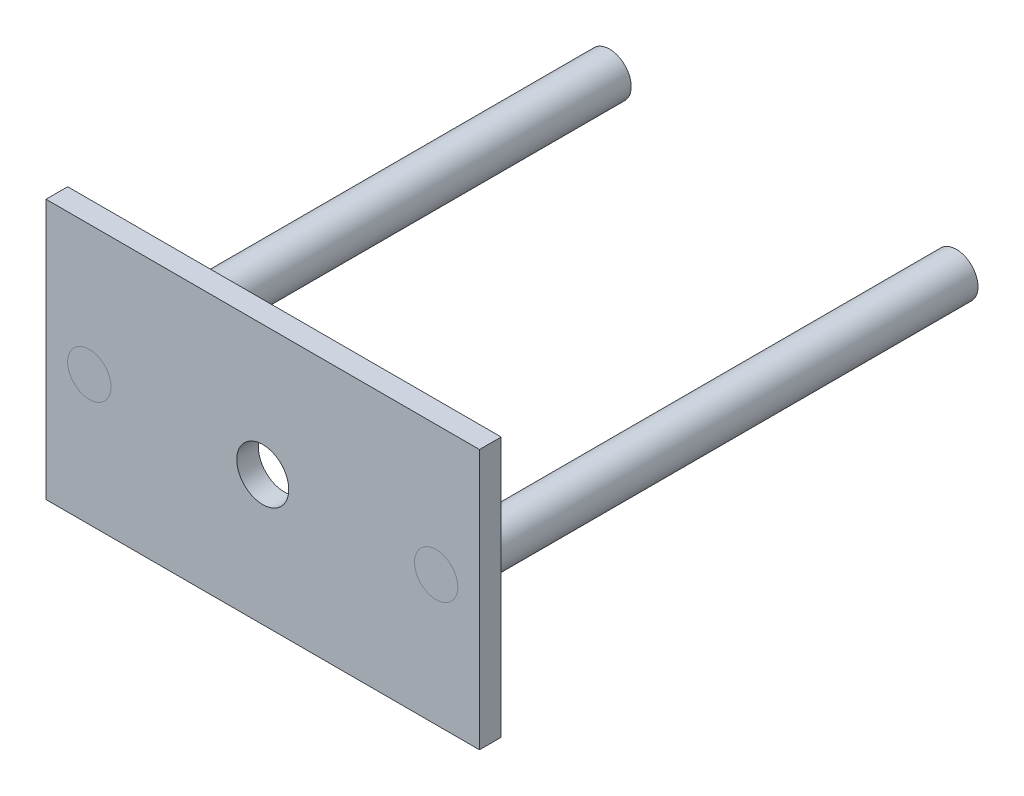
ISO-10303-21;
HEADER;
FILE_DESCRIPTION(('STEP AP214'),'2;1');
FILE_NAME('part.step','',(''),(''),'','','');
FILE_SCHEMA(('AUTOMOTIVE_DESIGN { 1 0 10303 214 1 1 1 1 }'));
ENDSEC;
DATA;
#1=APPLICATION_CONTEXT('core data for automotive mechanical design processes');
#2=APPLICATION_PROTOCOL_DEFINITION('international standard','automotive_design',2000,#1);
#3=PRODUCT_CONTEXT('',#1,'mechanical');
#4=PRODUCT('Part','Part','',(#3));
#5=PRODUCT_RELATED_PRODUCT_CATEGORY('part','',(#4));
#6=PRODUCT_DEFINITION_FORMATION('','',#4);
#7=PRODUCT_DEFINITION_CONTEXT('part definition',#1,'design');
#8=PRODUCT_DEFINITION('design','',#6,#7);
#9=PRODUCT_DEFINITION_SHAPE('','',#8);
#10=(LENGTH_UNIT() NAMED_UNIT(*) SI_UNIT(.MILLI.,.METRE.));
#11=(NAMED_UNIT(*) PLANE_ANGLE_UNIT() SI_UNIT($,.RADIAN.));
#12=(NAMED_UNIT(*) SI_UNIT($,.STERADIAN.) SOLID_ANGLE_UNIT());
#13=UNCERTAINTY_MEASURE_WITH_UNIT(LENGTH_MEASURE(1.E-05),#10,'distance_accuracy_value','');
#14=(GEOMETRIC_REPRESENTATION_CONTEXT(3) GLOBAL_UNCERTAINTY_ASSIGNED_CONTEXT((#13)) GLOBAL_UNIT_ASSIGNED_CONTEXT((#10,
#11,#12)) REPRESENTATION_CONTEXT('',''));
#15=CARTESIAN_POINT('',(0.,0.,0.));
#16=DIRECTION('',(0.,0.,1.));
#17=DIRECTION('',(1.,0.,0.));
#18=AXIS2_PLACEMENT_3D('',#15,#16,#17);
#19=CARTESIAN_POINT('',(-40.,0.,-115.));
#20=DIRECTION('',(0.,0.,1.));
#21=DIRECTION('',(1.,0.,0.));
#22=AXIS2_PLACEMENT_3D('',#19,#20,#21);
#23=CYLINDRICAL_SURFACE('',#22,5.);
#24=CARTESIAN_POINT('',(-40.,0.,-115.));
#25=DIRECTION('',(0.,0.,1.));
#26=DIRECTION('',(1.,0.,0.));
#27=AXIS2_PLACEMENT_3D('',#24,#25,#26);
#28=CIRCLE('',#27,5.);
#29=CARTESIAN_POINT('',(-35.,0.,-115.));
#30=VERTEX_POINT('',#29);
#31=EDGE_CURVE('E13',#30,#30,#28,.T.);
#32=ORIENTED_EDGE('',*,*,#31,.T.);
#33=EDGE_LOOP('',(#32));
#34=FACE_BOUND('',#33,.T.);
#35=CARTESIAN_POINT('',(-40.,0.,5.));
#36=DIRECTION('',(0.,0.,1.));
#37=DIRECTION('',(1.,0.,0.));
#38=AXIS2_PLACEMENT_3D('',#35,#36,#37);
#39=CIRCLE('',#38,5.);
#40=CARTESIAN_POINT('',(-35.,0.,5.));
#41=VERTEX_POINT('',#40);
#42=EDGE_CURVE('E60',#41,#41,#39,.T.);
#43=ORIENTED_EDGE('',*,*,#42,.F.);
#44=EDGE_LOOP('',(#43));
#45=FACE_BOUND('',#44,.T.);
#46=ADVANCED_FACE('F57',(#34,#45),#23,.T.);
#47=CARTESIAN_POINT('',(-40.,0.,-115.));
#48=DIRECTION('',(0.,0.,1.));
#49=DIRECTION('',(1.,0.,0.));
#50=AXIS2_PLACEMENT_3D('',#47,#48,#49);
#51=PLANE('',#50);
#52=ORIENTED_EDGE('',*,*,#31,.F.);
#53=EDGE_LOOP('',(#52));
#54=FACE_BOUND('',#53,.T.);
#55=ADVANCED_FACE('F72',(#54),#51,.F.);
#56=CARTESIAN_POINT('',(-40.,0.,5.));
#57=DIRECTION('',(0.,0.,1.));
#58=DIRECTION('',(1.,0.,0.));
#59=AXIS2_PLACEMENT_3D('',#56,#57,#58);
#60=PLANE('',#59);
#61=ORIENTED_EDGE('',*,*,#42,.T.);
#62=EDGE_LOOP('',(#61));
#63=FACE_BOUND('',#62,.T.);
#64=ADVANCED_FACE('F69',(#63),#60,.T.);
#65=CLOSED_SHELL('',(#46,#55,#64));
#66=MANIFOLD_SOLID_BREP('B2',#65);
#67=CARTESIAN_POINT('',(40.,0.,-115.));
#68=DIRECTION('',(0.,0.,1.));
#69=DIRECTION('',(1.,0.,0.));
#70=AXIS2_PLACEMENT_3D('',#67,#68,#69);
#71=CYLINDRICAL_SURFACE('',#70,5.);
#72=CARTESIAN_POINT('',(40.,0.,-115.));
#73=DIRECTION('',(0.,0.,1.));
#74=DIRECTION('',(1.,0.,0.));
#75=AXIS2_PLACEMENT_3D('',#72,#73,#74);
#76=CIRCLE('',#75,5.);
#77=CARTESIAN_POINT('',(45.,0.,-115.));
#78=VERTEX_POINT('',#77);
#79=EDGE_CURVE('E56',#78,#78,#76,.T.);
#80=ORIENTED_EDGE('',*,*,#79,.T.);
#81=EDGE_LOOP('',(#80));
#82=FACE_BOUND('',#81,.T.);
#83=CARTESIAN_POINT('',(40.,0.,5.));
#84=DIRECTION('',(0.,0.,1.));
#85=DIRECTION('',(1.,0.,0.));
#86=AXIS2_PLACEMENT_3D('',#83,#84,#85);
#87=CIRCLE('',#86,5.);
#88=CARTESIAN_POINT('',(45.,0.,5.));
#89=VERTEX_POINT('',#88);
#90=EDGE_CURVE('E117',#89,#89,#87,.T.);
#91=ORIENTED_EDGE('',*,*,#90,.F.);
#92=EDGE_LOOP('',(#91));
#93=FACE_BOUND('',#92,.T.);
#94=ADVANCED_FACE('F114',(#82,#93),#71,.T.);
#95=CARTESIAN_POINT('',(40.,0.,-115.));
#96=DIRECTION('',(0.,0.,1.));
#97=DIRECTION('',(1.,0.,0.));
#98=AXIS2_PLACEMENT_3D('',#95,#96,#97);
#99=PLANE('',#98);
#100=ORIENTED_EDGE('',*,*,#79,.F.);
#101=EDGE_LOOP('',(#100));
#102=FACE_BOUND('',#101,.T.);
#103=ADVANCED_FACE('F129',(#102),#99,.F.);
#104=CARTESIAN_POINT('',(40.,0.,5.));
#105=DIRECTION('',(0.,0.,1.));
#106=DIRECTION('',(1.,0.,0.));
#107=AXIS2_PLACEMENT_3D('',#104,#105,#106);
#108=PLANE('',#107);
#109=ORIENTED_EDGE('',*,*,#90,.T.);
#110=EDGE_LOOP('',(#109));
#111=FACE_BOUND('',#110,.T.);
#112=ADVANCED_FACE('F126',(#111),#108,.T.);
#113=CLOSED_SHELL('',(#94,#103,#112));
#114=MANIFOLD_SOLID_BREP('B8',#113);
#115=CARTESIAN_POINT('',(0.,0.,5.));
#116=DIRECTION('',(0.,0.,-1.));
#117=DIRECTION('',(-1.,0.,0.));
#118=AXIS2_PLACEMENT_3D('',#115,#116,#117);
#119=PLANE('',#118);
#120=DIRECTION('',(0.,1.,0.));
#121=VECTOR('',#120,1.);
#122=CARTESIAN_POINT('',(50.,-30.,5.));
#123=LINE('',#122,#121);
#124=CARTESIAN_POINT('',(50.,-30.,5.));
#125=VERTEX_POINT('',#124);
#126=CARTESIAN_POINT('',(50.,30.,5.));
#127=VERTEX_POINT('',#126);
#128=EDGE_CURVE('E212',#125,#127,#123,.T.);
#129=ORIENTED_EDGE('',*,*,#128,.T.);
#130=DIRECTION('',(-1.,0.,0.));
#131=VECTOR('',#130,1.);
#132=CARTESIAN_POINT('',(-50.,30.,5.));
#133=LINE('',#132,#131);
#134=CARTESIAN_POINT('',(-50.,30.,5.));
#135=VERTEX_POINT('',#134);
#136=EDGE_CURVE('E207',#127,#135,#133,.T.);
#137=ORIENTED_EDGE('',*,*,#136,.T.);
#138=DIRECTION('',(0.,-1.,0.));
#139=VECTOR('',#138,1.);
#140=CARTESIAN_POINT('',(-50.,-30.,5.));
#141=LINE('',#140,#139);
#142=CARTESIAN_POINT('',(-50.,-30.,5.));
#143=VERTEX_POINT('',#142);
#144=EDGE_CURVE('E210',#135,#143,#141,.T.);
#145=ORIENTED_EDGE('',*,*,#144,.T.);
#146=DIRECTION('',(1.,0.,0.));
#147=VECTOR('',#146,1.);
#148=CARTESIAN_POINT('',(-50.,-30.,5.));
#149=LINE('',#148,#147);
#150=EDGE_CURVE('E177',#143,#125,#149,.T.);
#151=ORIENTED_EDGE('',*,*,#150,.T.);
#152=EDGE_LOOP('',(#129,#137,#145,#151));
#153=FACE_BOUND('',#152,.T.);
#154=CARTESIAN_POINT('',(0.,0.,5.));
#155=DIRECTION('',(0.,0.,1.));
#156=DIRECTION('',(1.,0.,0.));
#157=AXIS2_PLACEMENT_3D('',#154,#155,#156);
#158=CIRCLE('',#157,6.);
#159=CARTESIAN_POINT('',(6.,0.,5.));
#160=VERTEX_POINT('',#159);
#161=EDGE_CURVE('E227',#160,#160,#158,.T.);
#162=ORIENTED_EDGE('',*,*,#161,.F.);
#163=EDGE_LOOP('',(#162));
#164=FACE_BOUND('',#163,.T.);
#165=CARTESIAN_POINT('',(-40.,0.,5.));
#166=DIRECTION('',(0.,0.,1.));
#167=DIRECTION('',(1.,0.,0.));
#168=AXIS2_PLACEMENT_3D('',#165,#166,#167);
#169=CIRCLE('',#168,5.);
#170=CARTESIAN_POINT('',(-35.,0.,5.));
#171=VERTEX_POINT('',#170);
#172=EDGE_CURVE('E242',#171,#171,#169,.T.);
#173=ORIENTED_EDGE('',*,*,#172,.F.);
#174=EDGE_LOOP('',(#173));
#175=FACE_BOUND('',#174,.T.);
#176=CARTESIAN_POINT('',(40.,0.,5.));
#177=DIRECTION('',(0.,0.,1.));
#178=DIRECTION('',(1.,0.,0.));
#179=AXIS2_PLACEMENT_3D('',#176,#177,#178);
#180=CIRCLE('',#179,5.);
#181=CARTESIAN_POINT('',(45.,0.,5.));
#182=VERTEX_POINT('',#181);
#183=EDGE_CURVE('E248',#182,#182,#180,.T.);
#184=ORIENTED_EDGE('',*,*,#183,.F.);
#185=EDGE_LOOP('',(#184));
#186=FACE_BOUND('',#185,.T.);
#187=ADVANCED_FACE('F160',(#153,#164,#175,#186),#119,.F.);
#188=CARTESIAN_POINT('',(0.,0.,0.));
#189=DIRECTION('',(0.,0.,-1.));
#190=DIRECTION('',(-1.,0.,0.));
#191=AXIS2_PLACEMENT_3D('',#188,#189,#190);
#192=PLANE('',#191);
#193=CARTESIAN_POINT('',(-40.,0.,0.));
#194=DIRECTION('',(0.,0.,1.));
#195=DIRECTION('',(1.,0.,0.));
#196=AXIS2_PLACEMENT_3D('',#193,#194,#195);
#197=CIRCLE('',#196,5.);
#198=CARTESIAN_POINT('',(-35.,0.,0.));
#199=VERTEX_POINT('',#198);
#200=EDGE_CURVE('E245',#199,#199,#197,.T.);
#201=ORIENTED_EDGE('',*,*,#200,.T.);
#202=EDGE_LOOP('',(#201));
#203=FACE_BOUND('',#202,.T.);
#204=DIRECTION('',(0.,1.,0.));
#205=VECTOR('',#204,1.);
#206=CARTESIAN_POINT('',(50.,-30.,0.));
#207=LINE('',#206,#205);
#208=CARTESIAN_POINT('',(50.,-30.,0.));
#209=VERTEX_POINT('',#208);
#210=CARTESIAN_POINT('',(50.,30.,0.));
#211=VERTEX_POINT('',#210);
#212=EDGE_CURVE('E224',#209,#211,#207,.T.);
#213=ORIENTED_EDGE('',*,*,#212,.F.);
#214=DIRECTION('',(1.,0.,0.));
#215=VECTOR('',#214,1.);
#216=CARTESIAN_POINT('',(-50.,-30.,0.));
#217=LINE('',#216,#215);
#218=CARTESIAN_POINT('',(-50.,-30.,0.));
#219=VERTEX_POINT('',#218);
#220=EDGE_CURVE('E200',#219,#209,#217,.T.);
#221=ORIENTED_EDGE('',*,*,#220,.F.);
#222=DIRECTION('',(0.,-1.,0.));
#223=VECTOR('',#222,1.);
#224=CARTESIAN_POINT('',(-50.,-30.,0.));
#225=LINE('',#224,#223);
#226=CARTESIAN_POINT('',(-50.,30.,0.));
#227=VERTEX_POINT('',#226);
#228=EDGE_CURVE('E194',#227,#219,#225,.T.);
#229=ORIENTED_EDGE('',*,*,#228,.F.);
#230=DIRECTION('',(-1.,0.,0.));
#231=VECTOR('',#230,1.);
#232=CARTESIAN_POINT('',(-50.,30.,0.));
#233=LINE('',#232,#231);
#234=EDGE_CURVE('E216',#211,#227,#233,.T.);
#235=ORIENTED_EDGE('',*,*,#234,.F.);
#236=EDGE_LOOP('',(#213,#221,#229,#235));
#237=FACE_BOUND('',#236,.T.);
#238=CARTESIAN_POINT('',(0.,0.,0.));
#239=DIRECTION('',(0.,0.,1.));
#240=DIRECTION('',(1.,0.,0.));
#241=AXIS2_PLACEMENT_3D('',#238,#239,#240);
#242=CIRCLE('',#241,6.);
#243=CARTESIAN_POINT('',(6.,0.,0.));
#244=VERTEX_POINT('',#243);
#245=EDGE_CURVE('E239',#244,#244,#242,.T.);
#246=ORIENTED_EDGE('',*,*,#245,.T.);
#247=EDGE_LOOP('',(#246));
#248=FACE_BOUND('',#247,.T.);
#249=CARTESIAN_POINT('',(40.,0.,0.));
#250=DIRECTION('',(0.,0.,1.));
#251=DIRECTION('',(1.,0.,0.));
#252=AXIS2_PLACEMENT_3D('',#249,#250,#251);
#253=CIRCLE('',#252,5.);
#254=CARTESIAN_POINT('',(45.,0.,0.));
#255=VERTEX_POINT('',#254);
#256=EDGE_CURVE('E251',#255,#255,#253,.T.);
#257=ORIENTED_EDGE('',*,*,#256,.T.);
#258=EDGE_LOOP('',(#257));
#259=FACE_BOUND('',#258,.T.);
#260=ADVANCED_FACE('F235',(#203,#237,#248,#259),#192,.T.);
#261=CARTESIAN_POINT('',(50.,-30.,5.));
#262=DIRECTION('',(-1.,0.,0.));
#263=DIRECTION('',(0.,0.,1.));
#264=AXIS2_PLACEMENT_3D('',#261,#262,#263);
#265=PLANE('',#264);
#266=ORIENTED_EDGE('',*,*,#212,.T.);
#267=DIRECTION('',(0.,0.,-1.));
#268=VECTOR('',#267,1.);
#269=CARTESIAN_POINT('',(50.,30.,5.));
#270=LINE('',#269,#268);
#271=EDGE_CURVE('E112',#127,#211,#270,.T.);
#272=ORIENTED_EDGE('',*,*,#271,.F.);
#273=ORIENTED_EDGE('',*,*,#128,.F.);
#274=DIRECTION('',(0.,0.,-1.));
#275=VECTOR('',#274,1.);
#276=CARTESIAN_POINT('',(50.,-30.,5.));
#277=LINE('',#276,#275);
#278=EDGE_CURVE('E220',#125,#209,#277,.T.);
#279=ORIENTED_EDGE('',*,*,#278,.T.);
#280=EDGE_LOOP('',(#266,#272,#273,#279));
#281=FACE_BOUND('',#280,.T.);
#282=ADVANCED_FACE('F162',(#281),#265,.F.);
#283=CARTESIAN_POINT('',(-50.,30.,5.));
#284=DIRECTION('',(0.,-1.,0.));
#285=DIRECTION('',(0.,0.,-1.));
#286=AXIS2_PLACEMENT_3D('',#283,#284,#285);
#287=PLANE('',#286);
#288=ORIENTED_EDGE('',*,*,#234,.T.);
#289=DIRECTION('',(0.,0.,-1.));
#290=VECTOR('',#289,1.);
#291=CARTESIAN_POINT('',(-50.,30.,5.));
#292=LINE('',#291,#290);
#293=EDGE_CURVE('E169',#135,#227,#292,.T.);
#294=ORIENTED_EDGE('',*,*,#293,.F.);
#295=ORIENTED_EDGE('',*,*,#136,.F.);
#296=ORIENTED_EDGE('',*,*,#271,.T.);
#297=EDGE_LOOP('',(#288,#294,#295,#296));
#298=FACE_BOUND('',#297,.T.);
#299=ADVANCED_FACE('F215',(#298),#287,.F.);
#300=CARTESIAN_POINT('',(-50.,-30.,5.));
#301=DIRECTION('',(1.,0.,0.));
#302=DIRECTION('',(0.,0.,-1.));
#303=AXIS2_PLACEMENT_3D('',#300,#301,#302);
#304=PLANE('',#303);
#305=ORIENTED_EDGE('',*,*,#228,.T.);
#306=DIRECTION('',(0.,0.,-1.));
#307=VECTOR('',#306,1.);
#308=CARTESIAN_POINT('',(-50.,-30.,5.));
#309=LINE('',#308,#307);
#310=EDGE_CURVE('E217',#143,#219,#309,.T.);
#311=ORIENTED_EDGE('',*,*,#310,.F.);
#312=ORIENTED_EDGE('',*,*,#144,.F.);
#313=ORIENTED_EDGE('',*,*,#293,.T.);
#314=EDGE_LOOP('',(#305,#311,#312,#313));
#315=FACE_BOUND('',#314,.T.);
#316=ADVANCED_FACE('F218',(#315),#304,.F.);
#317=CARTESIAN_POINT('',(-50.,-30.,5.));
#318=DIRECTION('',(0.,1.,0.));
#319=DIRECTION('',(0.,0.,1.));
#320=AXIS2_PLACEMENT_3D('',#317,#318,#319);
#321=PLANE('',#320);
#322=ORIENTED_EDGE('',*,*,#220,.T.);
#323=ORIENTED_EDGE('',*,*,#278,.F.);
#324=ORIENTED_EDGE('',*,*,#150,.F.);
#325=ORIENTED_EDGE('',*,*,#310,.T.);
#326=EDGE_LOOP('',(#322,#323,#324,#325));
#327=FACE_BOUND('',#326,.T.);
#328=ADVANCED_FACE('F232',(#327),#321,.F.);
#329=CARTESIAN_POINT('',(0.,0.,5.));
#330=DIRECTION('',(0.,0.,-1.));
#331=DIRECTION('',(-1.,0.,0.));
#332=AXIS2_PLACEMENT_3D('',#329,#330,#331);
#333=CYLINDRICAL_SURFACE('',#332,6.);
#334=ORIENTED_EDGE('',*,*,#161,.T.);
#335=EDGE_LOOP('',(#334));
#336=FACE_BOUND('',#335,.T.);
#337=ORIENTED_EDGE('',*,*,#245,.F.);
#338=EDGE_LOOP('',(#337));
#339=FACE_BOUND('',#338,.T.);
#340=ADVANCED_FACE('F268',(#336,#339),#333,.F.);
#341=CARTESIAN_POINT('',(-40.,0.,5.));
#342=DIRECTION('',(0.,0.,-1.));
#343=DIRECTION('',(-1.,0.,0.));
#344=AXIS2_PLACEMENT_3D('',#341,#342,#343);
#345=CYLINDRICAL_SURFACE('',#344,5.);
#346=ORIENTED_EDGE('',*,*,#172,.T.);
#347=EDGE_LOOP('',(#346));
#348=FACE_BOUND('',#347,.T.);
#349=ORIENTED_EDGE('',*,*,#200,.F.);
#350=EDGE_LOOP('',(#349));
#351=FACE_BOUND('',#350,.T.);
#352=ADVANCED_FACE('F314',(#348,#351),#345,.F.);
#353=CARTESIAN_POINT('',(40.,0.,5.));
#354=DIRECTION('',(0.,0.,-1.));
#355=DIRECTION('',(-1.,0.,0.));
#356=AXIS2_PLACEMENT_3D('',#353,#354,#355);
#357=CYLINDRICAL_SURFACE('',#356,5.);
#358=ORIENTED_EDGE('',*,*,#183,.T.);
#359=EDGE_LOOP('',(#358));
#360=FACE_BOUND('',#359,.T.);
#361=ORIENTED_EDGE('',*,*,#256,.F.);
#362=EDGE_LOOP('',(#361));
#363=FACE_BOUND('',#362,.T.);
#364=ADVANCED_FACE('F257',(#360,#363),#357,.F.);
#365=CLOSED_SHELL('',(#187,#260,#282,#299,#316,#328,#340,#352,#364));
#366=MANIFOLD_SOLID_BREP('B51',#365);
#367=ADVANCED_BREP_SHAPE_REPRESENTATION('',(#18,#66,#114,#366),#14);
#368=SHAPE_DEFINITION_REPRESENTATION(#9,#367);
ENDSEC;
END-ISO-10303-21;
